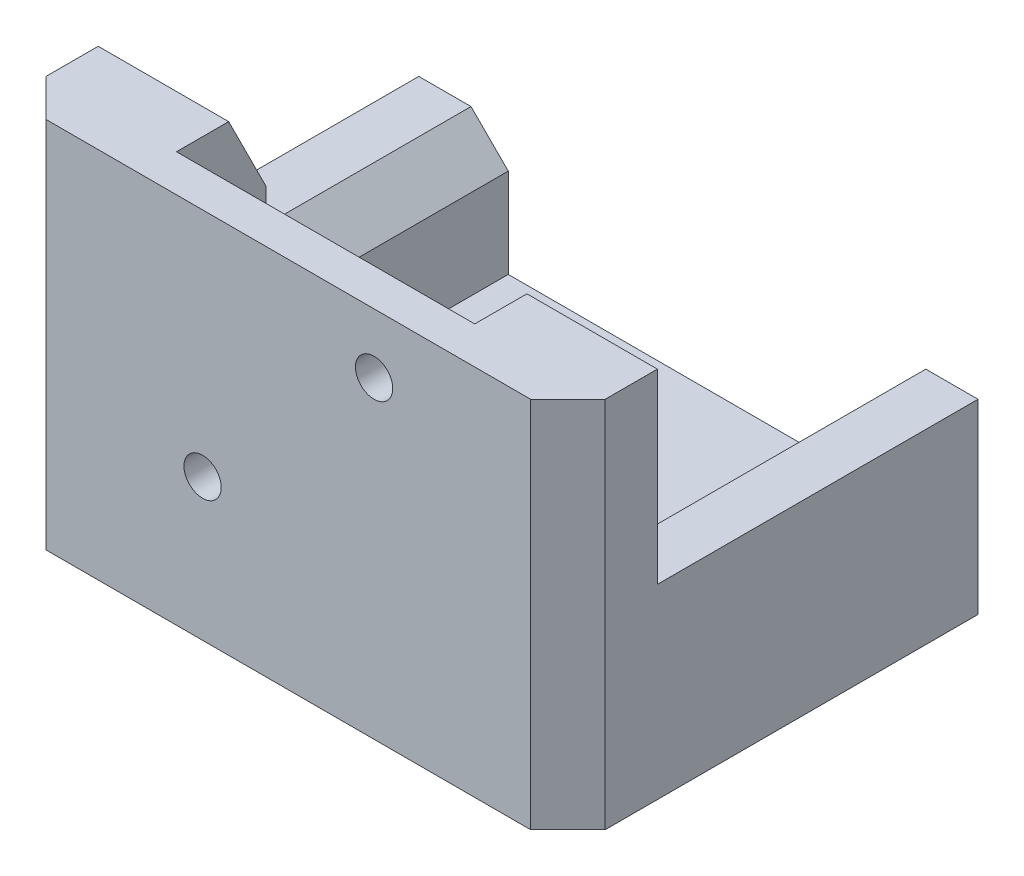
ISO-10303-21;
HEADER;
FILE_DESCRIPTION(('STEP AP214'),'2;1');
FILE_NAME('part.step','',(''),(''),'','','');
FILE_SCHEMA(('AUTOMOTIVE_DESIGN { 1 0 10303 214 1 1 1 1 }'));
ENDSEC;
DATA;
#1=APPLICATION_CONTEXT('core data for automotive mechanical design processes');
#2=APPLICATION_PROTOCOL_DEFINITION('international standard','automotive_design',2000,#1);
#3=PRODUCT_CONTEXT('',#1,'mechanical');
#4=PRODUCT('Part','Part','',(#3));
#5=PRODUCT_RELATED_PRODUCT_CATEGORY('part','',(#4));
#6=PRODUCT_DEFINITION_FORMATION('','',#4);
#7=PRODUCT_DEFINITION_CONTEXT('part definition',#1,'design');
#8=PRODUCT_DEFINITION('design','',#6,#7);
#9=PRODUCT_DEFINITION_SHAPE('','',#8);
#10=(LENGTH_UNIT() NAMED_UNIT(*) SI_UNIT(.MILLI.,.METRE.));
#11=(NAMED_UNIT(*) PLANE_ANGLE_UNIT() SI_UNIT($,.RADIAN.));
#12=(NAMED_UNIT(*) SI_UNIT($,.STERADIAN.) SOLID_ANGLE_UNIT());
#13=UNCERTAINTY_MEASURE_WITH_UNIT(LENGTH_MEASURE(1.E-05),#10,'distance_accuracy_value','');
#14=(GEOMETRIC_REPRESENTATION_CONTEXT(3) GLOBAL_UNCERTAINTY_ASSIGNED_CONTEXT((#13)) GLOBAL_UNIT_ASSIGNED_CONTEXT((#10,
#11,#12)) REPRESENTATION_CONTEXT('',''));
#15=CARTESIAN_POINT('',(0.,0.,0.));
#16=DIRECTION('',(0.,0.,1.));
#17=DIRECTION('',(1.,0.,0.));
#18=AXIS2_PLACEMENT_3D('',#15,#16,#17);
#19=CARTESIAN_POINT('',(0.,50.,-17.));
#20=DIRECTION('',(0.,0.,1.));
#21=DIRECTION('',(1.,0.,0.));
#22=AXIS2_PLACEMENT_3D('',#19,#20,#21);
#23=PLANE('',#22);
#24=DIRECTION('',(0.,-1.,0.));
#25=VECTOR('',#24,1.);
#26=CARTESIAN_POINT('',(57.5,50.,-17.));
#27=LINE('',#26,#25);
#28=CARTESIAN_POINT('',(57.5,39.9999999999999,-17.));
#29=VERTEX_POINT('',#28);
#30=CARTESIAN_POINT('',(57.5,8.,-17.));
#31=VERTEX_POINT('',#30);
#32=EDGE_CURVE('E192',#29,#31,#27,.T.);
#33=ORIENTED_EDGE('',*,*,#32,.F.);
#34=DIRECTION('',(1.,0.,0.));
#35=VECTOR('',#34,1.);
#36=CARTESIAN_POINT('',(0.,39.9999999999999,-17.));
#37=LINE('',#36,#35);
#38=CARTESIAN_POINT('',(64.9999999999999,39.9999999999999,-17.));
#39=VERTEX_POINT('',#38);
#40=EDGE_CURVE('E366',#29,#39,#37,.T.);
#41=ORIENTED_EDGE('',*,*,#40,.T.);
#42=DIRECTION('',(0.,-1.,0.));
#43=VECTOR('',#42,1.);
#44=CARTESIAN_POINT('',(64.9999999999999,50.,-17.));
#45=LINE('',#44,#43);
#46=CARTESIAN_POINT('',(64.9999999999999,21.9999999999999,-17.));
#47=VERTEX_POINT('',#46);
#48=EDGE_CURVE('E364',#39,#47,#45,.T.);
#49=ORIENTED_EDGE('',*,*,#48,.T.);
#50=DIRECTION('',(0.707106781186548,0.707106781186548,0.));
#51=VECTOR('',#50,1.);
#52=CARTESIAN_POINT('',(46.5,3.50000000000001,-17.));
#53=LINE('',#52,#51);
#54=CARTESIAN_POINT('',(63.,20.,-17.));
#55=VERTEX_POINT('',#54);
#56=EDGE_CURVE('E335',#47,#55,#53,.F.);
#57=ORIENTED_EDGE('',*,*,#56,.T.);
#58=DIRECTION('',(0.,1.,0.));
#59=VECTOR('',#58,1.);
#60=CARTESIAN_POINT('',(63.,0.,-17.));
#61=LINE('',#60,#59);
#62=CARTESIAN_POINT('',(63.,8.,-17.));
#63=VERTEX_POINT('',#62);
#64=EDGE_CURVE('E268',#63,#55,#61,.T.);
#65=ORIENTED_EDGE('',*,*,#64,.F.);
#66=DIRECTION('',(1.,0.,0.));
#67=VECTOR('',#66,1.);
#68=CARTESIAN_POINT('',(0.,8.,-17.));
#69=LINE('',#68,#67);
#70=EDGE_CURVE('E258',#31,#63,#69,.T.);
#71=ORIENTED_EDGE('',*,*,#70,.F.);
#72=EDGE_LOOP('',(#33,#41,#49,#57,#65,#71));
#73=FACE_BOUND('',#72,.T.);
#74=ADVANCED_FACE('F39',(#73),#23,.F.);
#75=DIRECTION('',(0.,1.,0.));
#76=VECTOR('',#75,1.);
#77=CARTESIAN_POINT('',(10.,50.,-17.));
#78=LINE('',#77,#76);
#79=CARTESIAN_POINT('',(10.,21.9999999999999,-17.));
#80=VERTEX_POINT('',#79);
#81=CARTESIAN_POINT('',(10.,40.,-17.));
#82=VERTEX_POINT('',#81);
#83=EDGE_CURVE('E343',#80,#82,#78,.T.);
#84=ORIENTED_EDGE('',*,*,#83,.T.);
#85=DIRECTION('',(1.,0.,0.));
#86=VECTOR('',#85,1.);
#87=CARTESIAN_POINT('',(0.,40.,-17.));
#88=LINE('',#87,#86);
#89=CARTESIAN_POINT('',(17.5,40.,-17.));
#90=VERTEX_POINT('',#89);
#91=EDGE_CURVE('E345',#82,#90,#88,.T.);
#92=ORIENTED_EDGE('',*,*,#91,.T.);
#93=DIRECTION('',(0.,1.,0.));
#94=VECTOR('',#93,1.);
#95=CARTESIAN_POINT('',(17.5,50.,-17.));
#96=LINE('',#95,#94);
#97=CARTESIAN_POINT('',(17.5,8.,-17.));
#98=VERTEX_POINT('',#97);
#99=EDGE_CURVE('E210',#98,#90,#96,.T.);
#100=ORIENTED_EDGE('',*,*,#99,.F.);
#101=CARTESIAN_POINT('',(12.,8.,-17.));
#102=VERTEX_POINT('',#101);
#103=EDGE_CURVE('E259',#102,#98,#69,.T.);
#104=ORIENTED_EDGE('',*,*,#103,.F.);
#105=DIRECTION('',(0.,-1.,0.));
#106=VECTOR('',#105,1.);
#107=CARTESIAN_POINT('',(12.,0.,-17.));
#108=LINE('',#107,#106);
#109=CARTESIAN_POINT('',(12.,20.,-17.));
#110=VERTEX_POINT('',#109);
#111=EDGE_CURVE('E266',#110,#102,#108,.T.);
#112=ORIENTED_EDGE('',*,*,#111,.F.);
#113=DIRECTION('',(0.707106781186549,-0.707106781186547,0.));
#114=VECTOR('',#113,1.);
#115=CARTESIAN_POINT('',(-9.00000000000002,41.,-17.));
#116=LINE('',#115,#114);
#117=EDGE_CURVE('E337',#110,#80,#116,.F.);
#118=ORIENTED_EDGE('',*,*,#117,.T.);
#119=EDGE_LOOP('',(#84,#92,#100,#104,#112,#118));
#120=FACE_BOUND('',#119,.T.);
#121=ADVANCED_FACE('F415',(#120),#23,.F.);
#122=CARTESIAN_POINT('',(63.,0.,-55.));
#123=DIRECTION('',(1.,0.,0.));
#124=DIRECTION('',(0.,0.,-1.));
#125=AXIS2_PLACEMENT_3D('',#122,#123,#124);
#126=PLANE('',#125);
#127=ORIENTED_EDGE('',*,*,#64,.T.);
#128=DIRECTION('',(0.,0.,-1.));
#129=VECTOR('',#128,1.);
#130=CARTESIAN_POINT('',(63.,20.,-55.));
#131=LINE('',#130,#129);
#132=CARTESIAN_POINT('',(63.,20.,-55.));
#133=VERTEX_POINT('',#132);
#134=EDGE_CURVE('E324',#55,#133,#131,.T.);
#135=ORIENTED_EDGE('',*,*,#134,.T.);
#136=DIRECTION('',(0.,1.,0.));
#137=VECTOR('',#136,1.);
#138=CARTESIAN_POINT('',(63.,0.,-55.));
#139=LINE('',#138,#137);
#140=CARTESIAN_POINT('',(63.,8.,-55.));
#141=VERTEX_POINT('',#140);
#142=EDGE_CURVE('E280',#141,#133,#139,.T.);
#143=ORIENTED_EDGE('',*,*,#142,.F.);
#144=DIRECTION('',(0.,0.,-1.));
#145=VECTOR('',#144,1.);
#146=CARTESIAN_POINT('',(63.,8.,-55.));
#147=LINE('',#146,#145);
#148=EDGE_CURVE('E261',#63,#141,#147,.T.);
#149=ORIENTED_EDGE('',*,*,#148,.F.);
#150=EDGE_LOOP('',(#127,#135,#143,#149));
#151=FACE_BOUND('',#150,.T.);
#152=ADVANCED_FACE('F450',(#151),#126,.F.);
#153=CARTESIAN_POINT('',(12.,0.,-55.));
#154=DIRECTION('',(-1.,0.,0.));
#155=DIRECTION('',(0.,0.,1.));
#156=AXIS2_PLACEMENT_3D('',#153,#154,#155);
#157=PLANE('',#156);
#158=DIRECTION('',(0.,-1.,0.));
#159=VECTOR('',#158,1.);
#160=CARTESIAN_POINT('',(12.,0.,-55.));
#161=LINE('',#160,#159);
#162=CARTESIAN_POINT('',(12.,20.,-55.));
#163=VERTEX_POINT('',#162);
#164=CARTESIAN_POINT('',(12.,8.,-55.));
#165=VERTEX_POINT('',#164);
#166=EDGE_CURVE('E265',#163,#165,#161,.T.);
#167=ORIENTED_EDGE('',*,*,#166,.F.);
#168=DIRECTION('',(0.,0.,1.));
#169=VECTOR('',#168,1.);
#170=CARTESIAN_POINT('',(12.,20.,-55.));
#171=LINE('',#170,#169);
#172=EDGE_CURVE('E330',#163,#110,#171,.T.);
#173=ORIENTED_EDGE('',*,*,#172,.T.);
#174=ORIENTED_EDGE('',*,*,#111,.T.);
#175=DIRECTION('',(0.,0.,1.));
#176=VECTOR('',#175,1.);
#177=CARTESIAN_POINT('',(12.,8.,-55.));
#178=LINE('',#177,#176);
#179=EDGE_CURVE('E255',#165,#102,#178,.T.);
#180=ORIENTED_EDGE('',*,*,#179,.F.);
#181=EDGE_LOOP('',(#167,#173,#174,#180));
#182=FACE_BOUND('',#181,.T.);
#183=ADVANCED_FACE('F410',(#182),#157,.F.);
#184=CARTESIAN_POINT('',(0.,50.,0.));
#185=DIRECTION('',(1.,0.,0.));
#186=DIRECTION('',(0.,0.,-1.));
#187=AXIS2_PLACEMENT_3D('',#184,#185,#186);
#188=PLANE('',#187);
#189=DIRECTION('',(0.,0.,1.));
#190=VECTOR('',#189,1.);
#191=CARTESIAN_POINT('',(0.,50.,0.));
#192=LINE('',#191,#190);
#193=CARTESIAN_POINT('',(0.,50.,-12.));
#194=VERTEX_POINT('',#193);
#195=CARTESIAN_POINT('',(0.,50.,-5.00000000000002));
#196=VERTEX_POINT('',#195);
#197=EDGE_CURVE('E289',#194,#196,#192,.T.);
#198=ORIENTED_EDGE('',*,*,#197,.F.);
#199=DIRECTION('',(0.,-1.,0.));
#200=VECTOR('',#199,1.);
#201=CARTESIAN_POINT('',(0.,50.,-12.));
#202=LINE('',#201,#200);
#203=CARTESIAN_POINT('',(0.,25.,-12.));
#204=VERTEX_POINT('',#203);
#205=EDGE_CURVE('E349',#194,#204,#202,.T.);
#206=ORIENTED_EDGE('',*,*,#205,.T.);
#207=DIRECTION('',(0.,0.,1.));
#208=VECTOR('',#207,1.);
#209=CARTESIAN_POINT('',(0.,25.,-55.));
#210=LINE('',#209,#208);
#211=CARTESIAN_POINT('',(0.,25.,-55.));
#212=VERTEX_POINT('',#211);
#213=EDGE_CURVE('E263',#212,#204,#210,.T.);
#214=ORIENTED_EDGE('',*,*,#213,.F.);
#215=DIRECTION('',(0.,1.,0.));
#216=VECTOR('',#215,1.);
#217=CARTESIAN_POINT('',(0.,0.,-55.));
#218=LINE('',#217,#216);
#219=CARTESIAN_POINT('',(0.,0.,-55.));
#220=VERTEX_POINT('',#219);
#221=EDGE_CURVE('E269',#220,#212,#218,.T.);
#222=ORIENTED_EDGE('',*,*,#221,.F.);
#223=DIRECTION('',(0.,0.,1.));
#224=VECTOR('',#223,1.);
#225=CARTESIAN_POINT('',(0.,0.,0.));
#226=LINE('',#225,#224);
#227=CARTESIAN_POINT('',(0.,0.,-5.00000000000002));
#228=VERTEX_POINT('',#227);
#229=EDGE_CURVE('E288',#220,#228,#226,.T.);
#230=ORIENTED_EDGE('',*,*,#229,.T.);
#231=DIRECTION('',(0.,1.,0.));
#232=VECTOR('',#231,1.);
#233=CARTESIAN_POINT('',(0.,50.,-5.00000000000002));
#234=LINE('',#233,#232);
#235=EDGE_CURVE('E313',#228,#196,#234,.T.);
#236=ORIENTED_EDGE('',*,*,#235,.T.);
#237=EDGE_LOOP('',(#198,#206,#214,#222,#230,#236));
#238=FACE_BOUND('',#237,.T.);
#239=ADVANCED_FACE('F396',(#238),#188,.F.);
#240=CARTESIAN_POINT('',(0.,50.,0.));
#241=DIRECTION('',(0.,0.,-1.));
#242=DIRECTION('',(-1.,0.,0.));
#243=AXIS2_PLACEMENT_3D('',#240,#241,#242);
#244=PLANE('',#243);
#245=CARTESIAN_POINT('',(49.,42.,0.));
#246=DIRECTION('',(0.,0.,-1.));
#247=DIRECTION('',(-1.,0.,0.));
#248=AXIS2_PLACEMENT_3D('',#245,#246,#247);
#249=CIRCLE('',#248,2.5);
#250=CARTESIAN_POINT('',(46.5,42.,0.));
#251=VERTEX_POINT('',#250);
#252=EDGE_CURVE('E220',#251,#251,#249,.T.);
#253=ORIENTED_EDGE('',*,*,#252,.T.);
#254=EDGE_LOOP('',(#253));
#255=FACE_BOUND('',#254,.T.);
#256=CARTESIAN_POINT('',(26.,19.,0.));
#257=DIRECTION('',(0.,0.,-1.));
#258=DIRECTION('',(-1.,0.,0.));
#259=AXIS2_PLACEMENT_3D('',#256,#257,#258);
#260=CIRCLE('',#259,2.5);
#261=CARTESIAN_POINT('',(23.5,19.,0.));
#262=VERTEX_POINT('',#261);
#263=EDGE_CURVE('E880',#262,#262,#260,.T.);
#264=ORIENTED_EDGE('',*,*,#263,.T.);
#265=EDGE_LOOP('',(#264));
#266=FACE_BOUND('',#265,.T.);
#267=DIRECTION('',(1.,0.,0.));
#268=VECTOR('',#267,1.);
#269=CARTESIAN_POINT('',(0.,50.,0.));
#270=LINE('',#269,#268);
#271=CARTESIAN_POINT('',(5.,50.,0.));
#272=VERTEX_POINT('',#271);
#273=CARTESIAN_POINT('',(70.,50.,0.));
#274=VERTEX_POINT('',#273);
#275=EDGE_CURVE('E291',#272,#274,#270,.T.);
#276=ORIENTED_EDGE('',*,*,#275,.F.);
#277=DIRECTION('',(0.,-1.,0.));
#278=VECTOR('',#277,1.);
#279=CARTESIAN_POINT('',(5.,50.,0.));
#280=LINE('',#279,#278);
#281=CARTESIAN_POINT('',(5.,0.,0.));
#282=VERTEX_POINT('',#281);
#283=EDGE_CURVE('E306',#272,#282,#280,.T.);
#284=ORIENTED_EDGE('',*,*,#283,.T.);
#285=DIRECTION('',(1.,0.,0.));
#286=VECTOR('',#285,1.);
#287=CARTESIAN_POINT('',(0.,0.,0.));
#288=LINE('',#287,#286);
#289=CARTESIAN_POINT('',(70.,0.,0.));
#290=VERTEX_POINT('',#289);
#291=EDGE_CURVE('E301',#282,#290,#288,.T.);
#292=ORIENTED_EDGE('',*,*,#291,.T.);
#293=DIRECTION('',(0.,1.,0.));
#294=VECTOR('',#293,1.);
#295=CARTESIAN_POINT('',(70.,50.,0.));
#296=LINE('',#295,#294);
#297=EDGE_CURVE('E298',#290,#274,#296,.T.);
#298=ORIENTED_EDGE('',*,*,#297,.T.);
#299=EDGE_LOOP('',(#276,#284,#292,#298));
#300=FACE_BOUND('',#299,.T.);
#301=ADVANCED_FACE('F434',(#255,#266,#300),#244,.F.);
#302=CARTESIAN_POINT('',(75.,50.,0.));
#303=DIRECTION('',(-1.,0.,0.));
#304=DIRECTION('',(0.,0.,1.));
#305=AXIS2_PLACEMENT_3D('',#302,#303,#304);
#306=PLANE('',#305);
#307=DIRECTION('',(0.,0.,1.));
#308=VECTOR('',#307,1.);
#309=CARTESIAN_POINT('',(75.,25.,-55.));
#310=LINE('',#309,#308);
#311=CARTESIAN_POINT('',(75.,25.,-55.));
#312=VERTEX_POINT('',#311);
#313=CARTESIAN_POINT('',(75.,25.,-12.));
#314=VERTEX_POINT('',#313);
#315=EDGE_CURVE('E63',#312,#314,#310,.T.);
#316=ORIENTED_EDGE('',*,*,#315,.T.);
#317=DIRECTION('',(0.,1.,0.));
#318=VECTOR('',#317,1.);
#319=CARTESIAN_POINT('',(75.,50.,-12.));
#320=LINE('',#319,#318);
#321=CARTESIAN_POINT('',(75.,50.,-12.));
#322=VERTEX_POINT('',#321);
#323=EDGE_CURVE('E368',#314,#322,#320,.T.);
#324=ORIENTED_EDGE('',*,*,#323,.T.);
#325=DIRECTION('',(0.,0.,-1.));
#326=VECTOR('',#325,1.);
#327=CARTESIAN_POINT('',(75.,50.,0.));
#328=LINE('',#327,#326);
#329=CARTESIAN_POINT('',(75.,50.,-5.));
#330=VERTEX_POINT('',#329);
#331=EDGE_CURVE('E295',#330,#322,#328,.T.);
#332=ORIENTED_EDGE('',*,*,#331,.F.);
#333=DIRECTION('',(0.,-1.,0.));
#334=VECTOR('',#333,1.);
#335=CARTESIAN_POINT('',(75.,50.,-5.));
#336=LINE('',#335,#334);
#337=CARTESIAN_POINT('',(75.,0.,-5.));
#338=VERTEX_POINT('',#337);
#339=EDGE_CURVE('E320',#330,#338,#336,.T.);
#340=ORIENTED_EDGE('',*,*,#339,.T.);
#341=DIRECTION('',(0.,0.,-1.));
#342=VECTOR('',#341,1.);
#343=CARTESIAN_POINT('',(75.,0.,0.));
#344=LINE('',#343,#342);
#345=CARTESIAN_POINT('',(75.,0.,-55.));
#346=VERTEX_POINT('',#345);
#347=EDGE_CURVE('E292',#338,#346,#344,.T.);
#348=ORIENTED_EDGE('',*,*,#347,.T.);
#349=DIRECTION('',(0.,-1.,0.));
#350=VECTOR('',#349,1.);
#351=CARTESIAN_POINT('',(75.,0.,-55.));
#352=LINE('',#351,#350);
#353=EDGE_CURVE('E275',#312,#346,#352,.T.);
#354=ORIENTED_EDGE('',*,*,#353,.F.);
#355=EDGE_LOOP('',(#316,#324,#332,#340,#348,#354));
#356=FACE_BOUND('',#355,.T.);
#357=ADVANCED_FACE('F382',(#356),#306,.F.);
#358=CARTESIAN_POINT('',(0.,50.,0.));
#359=DIRECTION('',(0.,-1.,0.));
#360=DIRECTION('',(0.,0.,-1.));
#361=AXIS2_PLACEMENT_3D('',#358,#359,#360);
#362=PLANE('',#361);
#363=ORIENTED_EDGE('',*,*,#331,.T.);
#364=DIRECTION('',(-1.,0.,0.));
#365=VECTOR('',#364,1.);
#366=CARTESIAN_POINT('',(0.,50.,-12.));
#367=LINE('',#366,#365);
#368=CARTESIAN_POINT('',(57.5,50.,-12.));
#369=VERTEX_POINT('',#368);
#370=EDGE_CURVE('E357',#322,#369,#367,.T.);
#371=ORIENTED_EDGE('',*,*,#370,.T.);
#372=DIRECTION('',(0.,0.,-1.));
#373=VECTOR('',#372,1.);
#374=CARTESIAN_POINT('',(57.5,50.,-5.));
#375=LINE('',#374,#373);
#376=CARTESIAN_POINT('',(57.5,50.,-5.));
#377=VERTEX_POINT('',#376);
#378=EDGE_CURVE('E222',#377,#369,#375,.T.);
#379=ORIENTED_EDGE('',*,*,#378,.F.);
#380=DIRECTION('',(1.,0.,0.));
#381=VECTOR('',#380,1.);
#382=CARTESIAN_POINT('',(57.5,50.,-5.));
#383=LINE('',#382,#381);
#384=CARTESIAN_POINT('',(17.5,50.,-5.));
#385=VERTEX_POINT('',#384);
#386=EDGE_CURVE('E196',#385,#377,#383,.T.);
#387=ORIENTED_EDGE('',*,*,#386,.F.);
#388=DIRECTION('',(0.,0.,-1.));
#389=VECTOR('',#388,1.);
#390=CARTESIAN_POINT('',(17.5,50.,-5.));
#391=LINE('',#390,#389);
#392=CARTESIAN_POINT('',(17.5,50.,-12.));
#393=VERTEX_POINT('',#392);
#394=EDGE_CURVE('E225',#385,#393,#391,.T.);
#395=ORIENTED_EDGE('',*,*,#394,.T.);
#396=DIRECTION('',(-1.,0.,0.));
#397=VECTOR('',#396,1.);
#398=CARTESIAN_POINT('',(0.,50.,-12.));
#399=LINE('',#398,#397);
#400=EDGE_CURVE('E340',#393,#194,#399,.T.);
#401=ORIENTED_EDGE('',*,*,#400,.T.);
#402=ORIENTED_EDGE('',*,*,#197,.T.);
#403=DIRECTION('',(-0.707106781186547,0.,-0.707106781186549));
#404=VECTOR('',#403,1.);
#405=CARTESIAN_POINT('',(5.,50.,0.));
#406=LINE('',#405,#404);
#407=EDGE_CURVE('E318',#196,#272,#406,.F.);
#408=ORIENTED_EDGE('',*,*,#407,.T.);
#409=ORIENTED_EDGE('',*,*,#275,.T.);
#410=DIRECTION('',(-0.707106781186549,0.,0.707106781186547));
#411=VECTOR('',#410,1.);
#412=CARTESIAN_POINT('',(75.,50.,-5.));
#413=LINE('',#412,#411);
#414=EDGE_CURVE('E316',#274,#330,#413,.F.);
#415=ORIENTED_EDGE('',*,*,#414,.T.);
#416=EDGE_LOOP('',(#363,#371,#379,#387,#395,#401,#402,#408,#409,#415));
#417=FACE_BOUND('',#416,.T.);
#418=ADVANCED_FACE('F426',(#417),#362,.F.);
#419=CARTESIAN_POINT('',(0.,0.,0.));
#420=DIRECTION('',(0.,-1.,0.));
#421=DIRECTION('',(0.,0.,-1.));
#422=AXIS2_PLACEMENT_3D('',#419,#420,#421);
#423=PLANE('',#422);
#424=CARTESIAN_POINT('',(68.5,0.,-8.));
#425=DIRECTION('',(0.,-1.,0.));
#426=DIRECTION('',(0.,0.,-1.));
#427=AXIS2_PLACEMENT_3D('',#424,#425,#426);
#428=CIRCLE('',#427,2.49999999999999);
#429=CARTESIAN_POINT('',(68.5,0.,-10.5));
#430=VERTEX_POINT('',#429);
#431=EDGE_CURVE('E235',#430,#430,#428,.T.);
#432=ORIENTED_EDGE('',*,*,#431,.F.);
#433=EDGE_LOOP('',(#432));
#434=FACE_BOUND('',#433,.T.);
#435=CARTESIAN_POINT('',(6.5,0.,-42.));
#436=DIRECTION('',(0.,-1.,0.));
#437=DIRECTION('',(0.,0.,-1.));
#438=AXIS2_PLACEMENT_3D('',#435,#436,#437);
#439=CIRCLE('',#438,2.5);
#440=CARTESIAN_POINT('',(6.5,0.,-44.5));
#441=VERTEX_POINT('',#440);
#442=EDGE_CURVE('E242',#441,#441,#439,.T.);
#443=ORIENTED_EDGE('',*,*,#442,.F.);
#444=EDGE_LOOP('',(#443));
#445=FACE_BOUND('',#444,.T.);
#446=CARTESIAN_POINT('',(68.5,0.,-42.));
#447=DIRECTION('',(0.,-1.,0.));
#448=DIRECTION('',(0.,0.,-1.));
#449=AXIS2_PLACEMENT_3D('',#446,#447,#448);
#450=CIRCLE('',#449,2.50000000000001);
#451=CARTESIAN_POINT('',(68.5,0.,-44.5));
#452=VERTEX_POINT('',#451);
#453=EDGE_CURVE('E229',#452,#452,#450,.T.);
#454=ORIENTED_EDGE('',*,*,#453,.F.);
#455=EDGE_LOOP('',(#454));
#456=FACE_BOUND('',#455,.T.);
#457=CARTESIAN_POINT('',(6.5,0.,-8.));
#458=DIRECTION('',(0.,-1.,0.));
#459=DIRECTION('',(0.,0.,-1.));
#460=AXIS2_PLACEMENT_3D('',#457,#458,#459);
#461=CIRCLE('',#460,2.5);
#462=CARTESIAN_POINT('',(6.5,0.,-10.5));
#463=VERTEX_POINT('',#462);
#464=EDGE_CURVE('E238',#463,#463,#461,.T.);
#465=ORIENTED_EDGE('',*,*,#464,.F.);
#466=EDGE_LOOP('',(#465));
#467=FACE_BOUND('',#466,.T.);
#468=ORIENTED_EDGE('',*,*,#291,.F.);
#469=DIRECTION('',(0.707106781186547,0.,0.707106781186549));
#470=VECTOR('',#469,1.);
#471=CARTESIAN_POINT('',(2.50000000000001,0.,-2.5));
#472=LINE('',#471,#470);
#473=EDGE_CURVE('E311',#282,#228,#472,.F.);
#474=ORIENTED_EDGE('',*,*,#473,.T.);
#475=ORIENTED_EDGE('',*,*,#229,.F.);
#476=DIRECTION('',(-1.,0.,0.));
#477=VECTOR('',#476,1.);
#478=CARTESIAN_POINT('',(75.,0.,-55.));
#479=LINE('',#478,#477);
#480=EDGE_CURVE('E278',#346,#220,#479,.T.);
#481=ORIENTED_EDGE('',*,*,#480,.F.);
#482=ORIENTED_EDGE('',*,*,#347,.F.);
#483=DIRECTION('',(0.707106781186549,0.,-0.707106781186547));
#484=VECTOR('',#483,1.);
#485=CARTESIAN_POINT('',(34.9999999999999,0.,35.));
#486=LINE('',#485,#484);
#487=EDGE_CURVE('E309',#338,#290,#486,.F.);
#488=ORIENTED_EDGE('',*,*,#487,.T.);
#489=EDGE_LOOP('',(#468,#474,#475,#481,#482,#488));
#490=FACE_BOUND('',#489,.T.);
#491=ADVANCED_FACE('F390',(#434,#445,#456,#467,#490),#423,.T.);
#492=CARTESIAN_POINT('',(75.,25.,-55.));
#493=DIRECTION('',(0.,-1.,0.));
#494=DIRECTION('',(0.,0.,-1.));
#495=AXIS2_PLACEMENT_3D('',#492,#493,#494);
#496=PLANE('',#495);
#497=DIRECTION('',(1.,0.,0.));
#498=VECTOR('',#497,1.);
#499=CARTESIAN_POINT('',(75.,25.,-55.));
#500=LINE('',#499,#498);
#501=CARTESIAN_POINT('',(68.,25.,-55.));
#502=VERTEX_POINT('',#501);
#503=EDGE_CURVE('E283',#502,#312,#500,.T.);
#504=ORIENTED_EDGE('',*,*,#503,.F.);
#505=DIRECTION('',(0.,0.,1.));
#506=VECTOR('',#505,1.);
#507=CARTESIAN_POINT('',(68.,25.,-55.));
#508=LINE('',#507,#506);
#509=CARTESIAN_POINT('',(68.,25.,-15.5));
#510=VERTEX_POINT('',#509);
#511=EDGE_CURVE('E55',#502,#510,#508,.T.);
#512=ORIENTED_EDGE('',*,*,#511,.T.);
#513=DIRECTION('',(-0.894427190999917,0.,-0.447213595499956));
#514=VECTOR('',#513,1.);
#515=CARTESIAN_POINT('',(57.8,25.,-20.5999999999999));
#516=LINE('',#515,#514);
#517=EDGE_CURVE('E11',#510,#314,#516,.F.);
#518=ORIENTED_EDGE('',*,*,#517,.T.);
#519=ORIENTED_EDGE('',*,*,#315,.F.);
#520=EDGE_LOOP('',(#504,#512,#518,#519));
#521=FACE_BOUND('',#520,.T.);
#522=ADVANCED_FACE('F381',(#521),#496,.F.);
#523=CARTESIAN_POINT('',(0.,0.,-55.));
#524=DIRECTION('',(0.,0.,1.));
#525=DIRECTION('',(1.,0.,0.));
#526=AXIS2_PLACEMENT_3D('',#523,#524,#525);
#527=PLANE('',#526);
#528=ORIENTED_EDGE('',*,*,#142,.T.);
#529=DIRECTION('',(-0.707106781186548,-0.707106781186548,0.));
#530=VECTOR('',#529,1.);
#531=CARTESIAN_POINT('',(68.,25.,-55.));
#532=LINE('',#531,#530);
#533=EDGE_CURVE('E328',#133,#502,#532,.F.);
#534=ORIENTED_EDGE('',*,*,#533,.T.);
#535=ORIENTED_EDGE('',*,*,#503,.T.);
#536=ORIENTED_EDGE('',*,*,#353,.T.);
#537=ORIENTED_EDGE('',*,*,#480,.T.);
#538=ORIENTED_EDGE('',*,*,#221,.T.);
#539=DIRECTION('',(1.,0.,0.));
#540=VECTOR('',#539,1.);
#541=CARTESIAN_POINT('',(0.,25.,-55.));
#542=LINE('',#541,#540);
#543=CARTESIAN_POINT('',(6.99999999999998,25.,-55.));
#544=VERTEX_POINT('',#543);
#545=EDGE_CURVE('E271',#212,#544,#542,.T.);
#546=ORIENTED_EDGE('',*,*,#545,.T.);
#547=DIRECTION('',(-0.707106781186549,0.707106781186547,0.));
#548=VECTOR('',#547,1.);
#549=CARTESIAN_POINT('',(12.,20.,-55.));
#550=LINE('',#549,#548);
#551=EDGE_CURVE('E326',#544,#163,#550,.F.);
#552=ORIENTED_EDGE('',*,*,#551,.T.);
#553=ORIENTED_EDGE('',*,*,#166,.T.);
#554=DIRECTION('',(1.,0.,0.));
#555=VECTOR('',#554,1.);
#556=CARTESIAN_POINT('',(0.,8.,-55.));
#557=LINE('',#556,#555);
#558=EDGE_CURVE('E250',#165,#141,#557,.T.);
#559=ORIENTED_EDGE('',*,*,#558,.T.);
#560=EDGE_LOOP('',(#528,#534,#535,#536,#537,#538,#546,#552,#553,#559));
#561=FACE_BOUND('',#560,.T.);
#562=ADVANCED_FACE('F386',(#561),#527,.F.);
#563=CARTESIAN_POINT('',(0.,25.,-55.));
#564=DIRECTION('',(0.,-1.,0.));
#565=DIRECTION('',(1.,0.,0.));
#566=AXIS2_PLACEMENT_3D('',#563,#564,#565);
#567=PLANE('',#566);
#568=ORIENTED_EDGE('',*,*,#213,.T.);
#569=DIRECTION('',(-0.894427190999917,0.,0.447213595499956));
#570=VECTOR('',#569,1.);
#571=CARTESIAN_POINT('',(17.2,25.,-20.5999999999999));
#572=LINE('',#571,#570);
#573=CARTESIAN_POINT('',(6.99999999999998,25.,-15.5));
#574=VERTEX_POINT('',#573);
#575=EDGE_CURVE('E352',#204,#574,#572,.F.);
#576=ORIENTED_EDGE('',*,*,#575,.T.);
#577=DIRECTION('',(0.,0.,-1.));
#578=VECTOR('',#577,1.);
#579=CARTESIAN_POINT('',(6.99999999999998,25.,-55.));
#580=LINE('',#579,#578);
#581=EDGE_CURVE('E333',#574,#544,#580,.T.);
#582=ORIENTED_EDGE('',*,*,#581,.T.);
#583=ORIENTED_EDGE('',*,*,#545,.F.);
#584=EDGE_LOOP('',(#568,#576,#582,#583));
#585=FACE_BOUND('',#584,.T.);
#586=ADVANCED_FACE('F400',(#585),#567,.F.);
#587=CARTESIAN_POINT('',(0.,8.,0.));
#588=DIRECTION('',(0.,-1.,0.));
#589=DIRECTION('',(0.,0.,-1.));
#590=AXIS2_PLACEMENT_3D('',#587,#588,#589);
#591=PLANE('',#590);
#592=ORIENTED_EDGE('',*,*,#103,.T.);
#593=DIRECTION('',(0.,0.,-1.));
#594=VECTOR('',#593,1.);
#595=CARTESIAN_POINT('',(17.5,8.,-5.));
#596=LINE('',#595,#594);
#597=CARTESIAN_POINT('',(17.5,8.,-5.));
#598=VERTEX_POINT('',#597);
#599=EDGE_CURVE('E195',#598,#98,#596,.T.);
#600=ORIENTED_EDGE('',*,*,#599,.F.);
#601=DIRECTION('',(-1.,0.,0.));
#602=VECTOR('',#601,1.);
#603=CARTESIAN_POINT('',(57.5,8.,-5.));
#604=LINE('',#603,#602);
#605=CARTESIAN_POINT('',(57.5,8.,-5.));
#606=VERTEX_POINT('',#605);
#607=EDGE_CURVE('E199',#606,#598,#604,.T.);
#608=ORIENTED_EDGE('',*,*,#607,.F.);
#609=DIRECTION('',(0.,0.,-1.));
#610=VECTOR('',#609,1.);
#611=CARTESIAN_POINT('',(57.5,8.,-5.));
#612=LINE('',#611,#610);
#613=EDGE_CURVE('E184',#606,#31,#612,.T.);
#614=ORIENTED_EDGE('',*,*,#613,.T.);
#615=ORIENTED_EDGE('',*,*,#70,.T.);
#616=ORIENTED_EDGE('',*,*,#148,.T.);
#617=ORIENTED_EDGE('',*,*,#558,.F.);
#618=ORIENTED_EDGE('',*,*,#179,.T.);
#619=EDGE_LOOP('',(#592,#600,#608,#614,#615,#616,#617,#618));
#620=FACE_BOUND('',#619,.T.);
#621=ADVANCED_FACE('F201',(#620),#591,.F.);
#622=CARTESIAN_POINT('',(6.5,10.,-8.));
#623=DIRECTION('',(0.,-1.,0.));
#624=DIRECTION('',(0.,0.,-1.));
#625=AXIS2_PLACEMENT_3D('',#622,#623,#624);
#626=CYLINDRICAL_SURFACE('',#625,2.5);
#627=CARTESIAN_POINT('',(6.5,10.,-8.));
#628=DIRECTION('',(0.,-1.,0.));
#629=DIRECTION('',(0.,0.,-1.));
#630=AXIS2_PLACEMENT_3D('',#627,#628,#629);
#631=CIRCLE('',#630,2.5);
#632=CARTESIAN_POINT('',(6.5,10.,-10.5));
#633=VERTEX_POINT('',#632);
#634=EDGE_CURVE('E247',#633,#633,#631,.T.);
#635=ORIENTED_EDGE('',*,*,#634,.F.);
#636=EDGE_LOOP('',(#635));
#637=FACE_BOUND('',#636,.T.);
#638=ORIENTED_EDGE('',*,*,#464,.T.);
#639=EDGE_LOOP('',(#638));
#640=FACE_BOUND('',#639,.T.);
#641=ADVANCED_FACE('F632',(#637,#640),#626,.F.);
#642=CARTESIAN_POINT('',(6.5,10.,-8.));
#643=DIRECTION('',(0.,-1.,0.));
#644=DIRECTION('',(0.,0.,-1.));
#645=AXIS2_PLACEMENT_3D('',#642,#643,#644);
#646=PLANE('',#645);
#647=ORIENTED_EDGE('',*,*,#634,.T.);
#648=EDGE_LOOP('',(#647));
#649=FACE_BOUND('',#648,.T.);
#650=ADVANCED_FACE('F624',(#649),#646,.T.);
#651=CARTESIAN_POINT('',(68.5,10.,-42.));
#652=DIRECTION('',(0.,-1.,0.));
#653=DIRECTION('',(0.,0.,-1.));
#654=AXIS2_PLACEMENT_3D('',#651,#652,#653);
#655=CYLINDRICAL_SURFACE('',#654,2.50000000000001);
#656=CARTESIAN_POINT('',(68.5,10.,-42.));
#657=DIRECTION('',(0.,-1.,0.));
#658=DIRECTION('',(0.,0.,-1.));
#659=AXIS2_PLACEMENT_3D('',#656,#657,#658);
#660=CIRCLE('',#659,2.50000000000001);
#661=CARTESIAN_POINT('',(68.5,10.,-44.5));
#662=VERTEX_POINT('',#661);
#663=EDGE_CURVE('E224',#662,#662,#660,.T.);
#664=ORIENTED_EDGE('',*,*,#663,.F.);
#665=EDGE_LOOP('',(#664));
#666=FACE_BOUND('',#665,.T.);
#667=ORIENTED_EDGE('',*,*,#453,.T.);
#668=EDGE_LOOP('',(#667));
#669=FACE_BOUND('',#668,.T.);
#670=ADVANCED_FACE('F616',(#666,#669),#655,.F.);
#671=CARTESIAN_POINT('',(68.5,10.,-42.));
#672=DIRECTION('',(0.,-1.,0.));
#673=DIRECTION('',(0.,0.,-1.));
#674=AXIS2_PLACEMENT_3D('',#671,#672,#673);
#675=PLANE('',#674);
#676=ORIENTED_EDGE('',*,*,#663,.T.);
#677=EDGE_LOOP('',(#676));
#678=FACE_BOUND('',#677,.T.);
#679=ADVANCED_FACE('F608',(#678),#675,.T.);
#680=CARTESIAN_POINT('',(6.5,10.,-42.));
#681=DIRECTION('',(0.,-1.,0.));
#682=DIRECTION('',(0.,0.,-1.));
#683=AXIS2_PLACEMENT_3D('',#680,#681,#682);
#684=CYLINDRICAL_SURFACE('',#683,2.5);
#685=CARTESIAN_POINT('',(6.5,10.,-42.));
#686=DIRECTION('',(0.,-1.,0.));
#687=DIRECTION('',(0.,0.,-1.));
#688=AXIS2_PLACEMENT_3D('',#685,#686,#687);
#689=CIRCLE('',#688,2.5);
#690=CARTESIAN_POINT('',(6.5,10.,-44.5));
#691=VERTEX_POINT('',#690);
#692=EDGE_CURVE('E232',#691,#691,#689,.T.);
#693=ORIENTED_EDGE('',*,*,#692,.F.);
#694=EDGE_LOOP('',(#693));
#695=FACE_BOUND('',#694,.T.);
#696=ORIENTED_EDGE('',*,*,#442,.T.);
#697=EDGE_LOOP('',(#696));
#698=FACE_BOUND('',#697,.T.);
#699=ADVANCED_FACE('F600',(#695,#698),#684,.F.);
#700=CARTESIAN_POINT('',(6.5,10.,-42.));
#701=DIRECTION('',(0.,-1.,0.));
#702=DIRECTION('',(0.,0.,-1.));
#703=AXIS2_PLACEMENT_3D('',#700,#701,#702);
#704=PLANE('',#703);
#705=ORIENTED_EDGE('',*,*,#692,.T.);
#706=EDGE_LOOP('',(#705));
#707=FACE_BOUND('',#706,.T.);
#708=ADVANCED_FACE('F592',(#707),#704,.T.);
#709=CARTESIAN_POINT('',(68.5,10.,-8.));
#710=DIRECTION('',(0.,-1.,0.));
#711=DIRECTION('',(0.,0.,-1.));
#712=AXIS2_PLACEMENT_3D('',#709,#710,#711);
#713=CYLINDRICAL_SURFACE('',#712,2.49999999999999);
#714=CARTESIAN_POINT('',(68.5,10.,-8.));
#715=DIRECTION('',(0.,-1.,0.));
#716=DIRECTION('',(0.,0.,-1.));
#717=AXIS2_PLACEMENT_3D('',#714,#715,#716);
#718=CIRCLE('',#717,2.49999999999999);
#719=CARTESIAN_POINT('',(68.5,10.,-10.5));
#720=VERTEX_POINT('',#719);
#721=EDGE_CURVE('E239',#720,#720,#718,.T.);
#722=ORIENTED_EDGE('',*,*,#721,.F.);
#723=EDGE_LOOP('',(#722));
#724=FACE_BOUND('',#723,.T.);
#725=ORIENTED_EDGE('',*,*,#431,.T.);
#726=EDGE_LOOP('',(#725));
#727=FACE_BOUND('',#726,.T.);
#728=ADVANCED_FACE('F584',(#724,#727),#713,.F.);
#729=CARTESIAN_POINT('',(68.5,10.,-8.));
#730=DIRECTION('',(0.,-1.,0.));
#731=DIRECTION('',(0.,0.,-1.));
#732=AXIS2_PLACEMENT_3D('',#729,#730,#731);
#733=PLANE('',#732);
#734=ORIENTED_EDGE('',*,*,#721,.T.);
#735=EDGE_LOOP('',(#734));
#736=FACE_BOUND('',#735,.T.);
#737=ADVANCED_FACE('F576',(#736),#733,.T.);
#738=CARTESIAN_POINT('',(57.5,50.,-5.));
#739=DIRECTION('',(1.,0.,0.));
#740=DIRECTION('',(0.,0.,-1.));
#741=AXIS2_PLACEMENT_3D('',#738,#739,#740);
#742=PLANE('',#741);
#743=ORIENTED_EDGE('',*,*,#378,.T.);
#744=DIRECTION('',(0.,0.894427190999917,0.447213595499956));
#745=VECTOR('',#744,1.);
#746=CARTESIAN_POINT('',(57.5,50.,-12.));
#747=LINE('',#746,#745);
#748=EDGE_CURVE('E362',#369,#29,#747,.F.);
#749=ORIENTED_EDGE('',*,*,#748,.T.);
#750=ORIENTED_EDGE('',*,*,#32,.T.);
#751=ORIENTED_EDGE('',*,*,#613,.F.);
#752=DIRECTION('',(0.,-1.,0.));
#753=VECTOR('',#752,1.);
#754=CARTESIAN_POINT('',(57.5,50.,-5.));
#755=LINE('',#754,#753);
#756=EDGE_CURVE('E189',#377,#606,#755,.T.);
#757=ORIENTED_EDGE('',*,*,#756,.F.);
#758=EDGE_LOOP('',(#743,#749,#750,#751,#757));
#759=FACE_BOUND('',#758,.T.);
#760=ADVANCED_FACE('F187',(#759),#742,.F.);
#761=CARTESIAN_POINT('',(17.5,50.,-5.));
#762=DIRECTION('',(-1.,0.,0.));
#763=DIRECTION('',(0.,-1.,0.));
#764=AXIS2_PLACEMENT_3D('',#761,#762,#763);
#765=PLANE('',#764);
#766=ORIENTED_EDGE('',*,*,#99,.T.);
#767=DIRECTION('',(0.,-0.894427190999917,-0.447213595499956));
#768=VECTOR('',#767,1.);
#769=CARTESIAN_POINT('',(17.5,50.,-12.));
#770=LINE('',#769,#768);
#771=EDGE_CURVE('E347',#90,#393,#770,.F.);
#772=ORIENTED_EDGE('',*,*,#771,.T.);
#773=ORIENTED_EDGE('',*,*,#394,.F.);
#774=DIRECTION('',(0.,1.,0.));
#775=VECTOR('',#774,1.);
#776=CARTESIAN_POINT('',(17.5,50.,-5.));
#777=LINE('',#776,#775);
#778=EDGE_CURVE('E205',#598,#385,#777,.T.);
#779=ORIENTED_EDGE('',*,*,#778,.F.);
#780=ORIENTED_EDGE('',*,*,#599,.T.);
#781=EDGE_LOOP('',(#766,#772,#773,#779,#780));
#782=FACE_BOUND('',#781,.T.);
#783=ADVANCED_FACE('F419',(#782),#765,.F.);
#784=CARTESIAN_POINT('',(0.,0.,-5.));
#785=DIRECTION('',(0.,0.,-1.));
#786=DIRECTION('',(-1.,0.,0.));
#787=AXIS2_PLACEMENT_3D('',#784,#785,#786);
#788=PLANE('',#787);
#789=CARTESIAN_POINT('',(49.,42.,-5.));
#790=DIRECTION('',(0.,0.,-1.));
#791=DIRECTION('',(-1.,0.,0.));
#792=AXIS2_PLACEMENT_3D('',#789,#790,#791);
#793=CIRCLE('',#792,2.5);
#794=CARTESIAN_POINT('',(46.5,42.,-5.));
#795=VERTEX_POINT('',#794);
#796=EDGE_CURVE('E876',#795,#795,#793,.T.);
#797=ORIENTED_EDGE('',*,*,#796,.F.);
#798=EDGE_LOOP('',(#797));
#799=FACE_BOUND('',#798,.T.);
#800=CARTESIAN_POINT('',(26.,19.,-5.));
#801=DIRECTION('',(0.,0.,-1.));
#802=DIRECTION('',(-1.,0.,0.));
#803=AXIS2_PLACEMENT_3D('',#800,#801,#802);
#804=CIRCLE('',#803,2.5);
#805=CARTESIAN_POINT('',(23.5,19.,-5.));
#806=VERTEX_POINT('',#805);
#807=EDGE_CURVE('E215',#806,#806,#804,.T.);
#808=ORIENTED_EDGE('',*,*,#807,.F.);
#809=EDGE_LOOP('',(#808));
#810=FACE_BOUND('',#809,.T.);
#811=ORIENTED_EDGE('',*,*,#756,.T.);
#812=ORIENTED_EDGE('',*,*,#607,.T.);
#813=ORIENTED_EDGE('',*,*,#778,.T.);
#814=ORIENTED_EDGE('',*,*,#386,.T.);
#815=EDGE_LOOP('',(#811,#812,#813,#814));
#816=FACE_BOUND('',#815,.T.);
#817=ADVANCED_FACE('F207',(#799,#810,#816),#788,.T.);
#818=CARTESIAN_POINT('',(26.,19.,0.));
#819=DIRECTION('',(0.,0.,-1.));
#820=DIRECTION('',(-1.,0.,0.));
#821=AXIS2_PLACEMENT_3D('',#818,#819,#820);
#822=CYLINDRICAL_SURFACE('',#821,2.5);
#823=ORIENTED_EDGE('',*,*,#263,.F.);
#824=EDGE_LOOP('',(#823));
#825=FACE_BOUND('',#824,.T.);
#826=ORIENTED_EDGE('',*,*,#807,.T.);
#827=EDGE_LOOP('',(#826));
#828=FACE_BOUND('',#827,.T.);
#829=ADVANCED_FACE('F548',(#825,#828),#822,.F.);
#830=CARTESIAN_POINT('',(49.,42.,0.));
#831=DIRECTION('',(0.,0.,-1.));
#832=DIRECTION('',(-1.,0.,0.));
#833=AXIS2_PLACEMENT_3D('',#830,#831,#832);
#834=CYLINDRICAL_SURFACE('',#833,2.5);
#835=ORIENTED_EDGE('',*,*,#252,.F.);
#836=EDGE_LOOP('',(#835));
#837=FACE_BOUND('',#836,.T.);
#838=ORIENTED_EDGE('',*,*,#796,.T.);
#839=EDGE_LOOP('',(#838));
#840=FACE_BOUND('',#839,.T.);
#841=ADVANCED_FACE('F479',(#837,#840),#834,.F.);
#842=CARTESIAN_POINT('',(5.,50.,0.));
#843=DIRECTION('',(0.707106781186549,0.,-0.707106781186547));
#844=DIRECTION('',(0.,-1.,0.));
#845=AXIS2_PLACEMENT_3D('',#842,#843,#844);
#846=PLANE('',#845);
#847=ORIENTED_EDGE('',*,*,#407,.F.);
#848=ORIENTED_EDGE('',*,*,#235,.F.);
#849=ORIENTED_EDGE('',*,*,#473,.F.);
#850=ORIENTED_EDGE('',*,*,#283,.F.);
#851=EDGE_LOOP('',(#847,#848,#849,#850));
#852=FACE_BOUND('',#851,.T.);
#853=ADVANCED_FACE('F430',(#852),#846,.F.);
#854=CARTESIAN_POINT('',(75.,50.,-5.));
#855=DIRECTION('',(-0.707106781186547,0.,-0.707106781186549));
#856=DIRECTION('',(0.,-1.,0.));
#857=AXIS2_PLACEMENT_3D('',#854,#855,#856);
#858=PLANE('',#857);
#859=ORIENTED_EDGE('',*,*,#414,.F.);
#860=ORIENTED_EDGE('',*,*,#297,.F.);
#861=ORIENTED_EDGE('',*,*,#487,.F.);
#862=ORIENTED_EDGE('',*,*,#339,.F.);
#863=EDGE_LOOP('',(#859,#860,#861,#862));
#864=FACE_BOUND('',#863,.T.);
#865=ADVANCED_FACE('F437',(#864),#858,.F.);
#866=CARTESIAN_POINT('',(68.,25.,-55.));
#867=DIRECTION('',(0.707106781186547,-0.707106781186547,0.));
#868=DIRECTION('',(0.,0.,1.));
#869=AXIS2_PLACEMENT_3D('',#866,#867,#868);
#870=PLANE('',#869);
#871=ORIENTED_EDGE('',*,*,#533,.F.);
#872=ORIENTED_EDGE('',*,*,#134,.F.);
#873=ORIENTED_EDGE('',*,*,#56,.F.);
#874=DIRECTION('',(0.666666666666667,0.666666666666667,0.333333333333332));
#875=VECTOR('',#874,1.);
#876=CARTESIAN_POINT('',(77.4444444444444,34.4444444444444,-10.7777777777778));
#877=LINE('',#876,#875);
#878=EDGE_CURVE('E49',#47,#510,#877,.T.);
#879=ORIENTED_EDGE('',*,*,#878,.T.);
#880=ORIENTED_EDGE('',*,*,#511,.F.);
#881=EDGE_LOOP('',(#871,#872,#873,#879,#880));
#882=FACE_BOUND('',#881,.T.);
#883=ADVANCED_FACE('F375',(#882),#870,.F.);
#884=CARTESIAN_POINT('',(12.,20.,-55.));
#885=DIRECTION('',(-0.707106781186547,-0.707106781186549,0.));
#886=DIRECTION('',(0.,0.,1.));
#887=AXIS2_PLACEMENT_3D('',#884,#885,#886);
#888=PLANE('',#887);
#889=ORIENTED_EDGE('',*,*,#551,.F.);
#890=ORIENTED_EDGE('',*,*,#581,.F.);
#891=DIRECTION('',(0.666666666666668,-0.666666666666666,-0.333333333333332));
#892=VECTOR('',#891,1.);
#893=CARTESIAN_POINT('',(-8.00000000000002,40.,-8.00000000000001));
#894=LINE('',#893,#892);
#895=EDGE_CURVE('E355',#574,#80,#894,.T.);
#896=ORIENTED_EDGE('',*,*,#895,.T.);
#897=ORIENTED_EDGE('',*,*,#117,.F.);
#898=ORIENTED_EDGE('',*,*,#172,.F.);
#899=EDGE_LOOP('',(#889,#890,#896,#897,#898));
#900=FACE_BOUND('',#899,.T.);
#901=ADVANCED_FACE('F404',(#900),#888,.F.);
#902=CARTESIAN_POINT('',(0.,50.,-12.));
#903=DIRECTION('',(0.447213595499956,0.,0.894427190999917));
#904=DIRECTION('',(0.,-1.,0.));
#905=AXIS2_PLACEMENT_3D('',#902,#903,#904);
#906=PLANE('',#905);
#907=ORIENTED_EDGE('',*,*,#575,.F.);
#908=ORIENTED_EDGE('',*,*,#205,.F.);
#909=DIRECTION('',(0.666666666666667,-0.666666666666667,-0.333333333333332));
#910=VECTOR('',#909,1.);
#911=CARTESIAN_POINT('',(0.,50.,-12.));
#912=LINE('',#911,#910);
#913=EDGE_CURVE('E358',#82,#194,#912,.F.);
#914=ORIENTED_EDGE('',*,*,#913,.F.);
#915=ORIENTED_EDGE('',*,*,#83,.F.);
#916=ORIENTED_EDGE('',*,*,#895,.F.);
#917=EDGE_LOOP('',(#907,#908,#914,#915,#916));
#918=FACE_BOUND('',#917,.T.);
#919=ADVANCED_FACE('F495',(#918),#906,.F.);
#920=CARTESIAN_POINT('',(0.,50.,-12.));
#921=DIRECTION('',(0.,-0.447213595499956,0.894427190999917));
#922=DIRECTION('',(-1.,0.,0.));
#923=AXIS2_PLACEMENT_3D('',#920,#921,#922);
#924=PLANE('',#923);
#925=ORIENTED_EDGE('',*,*,#771,.F.);
#926=ORIENTED_EDGE('',*,*,#91,.F.);
#927=ORIENTED_EDGE('',*,*,#913,.T.);
#928=ORIENTED_EDGE('',*,*,#400,.F.);
#929=EDGE_LOOP('',(#925,#926,#927,#928));
#930=FACE_BOUND('',#929,.T.);
#931=ADVANCED_FACE('F422',(#930),#924,.F.);
#932=CARTESIAN_POINT('',(64.9999999999999,50.,-17.));
#933=DIRECTION('',(-0.447213595499956,0.,0.894427190999917));
#934=DIRECTION('',(0.,-1.,0.));
#935=AXIS2_PLACEMENT_3D('',#932,#933,#934);
#936=PLANE('',#935);
#937=ORIENTED_EDGE('',*,*,#878,.F.);
#938=ORIENTED_EDGE('',*,*,#48,.F.);
#939=DIRECTION('',(0.666666666666667,0.666666666666667,0.333333333333332));
#940=VECTOR('',#939,1.);
#941=CARTESIAN_POINT('',(69.4444444444444,44.4444444444444,-14.7777777777778));
#942=LINE('',#941,#940);
#943=EDGE_CURVE('E44',#322,#39,#942,.F.);
#944=ORIENTED_EDGE('',*,*,#943,.F.);
#945=ORIENTED_EDGE('',*,*,#323,.F.);
#946=ORIENTED_EDGE('',*,*,#517,.F.);
#947=EDGE_LOOP('',(#937,#938,#944,#945,#946));
#948=FACE_BOUND('',#947,.T.);
#949=ADVANCED_FACE('F42',(#948),#936,.F.);
#950=CARTESIAN_POINT('',(0.,50.,-12.));
#951=DIRECTION('',(0.,-0.447213595499956,0.894427190999917));
#952=DIRECTION('',(-1.,0.,0.));
#953=AXIS2_PLACEMENT_3D('',#950,#951,#952);
#954=PLANE('',#953);
#955=ORIENTED_EDGE('',*,*,#943,.T.);
#956=ORIENTED_EDGE('',*,*,#40,.F.);
#957=ORIENTED_EDGE('',*,*,#748,.F.);
#958=ORIENTED_EDGE('',*,*,#370,.F.);
#959=EDGE_LOOP('',(#955,#956,#957,#958));
#960=FACE_BOUND('',#959,.T.);
#961=ADVANCED_FACE('F444',(#960),#954,.F.);
#962=CLOSED_SHELL('',(#74,#121,#152,#183,#239,#301,#357,#418,#491,#522,#562,#586,#621,#641,#650,
#670,#679,#699,#708,#728,#737,#760,#783,#817,#829,#841,#853,#865,#883,#901,#919,#931,#949,#961));
#963=MANIFOLD_SOLID_BREP('B2',#962);
#964=ADVANCED_BREP_SHAPE_REPRESENTATION('',(#18,#963),#14);
#965=SHAPE_DEFINITION_REPRESENTATION(#9,#964);
ENDSEC;
END-ISO-10303-21;
